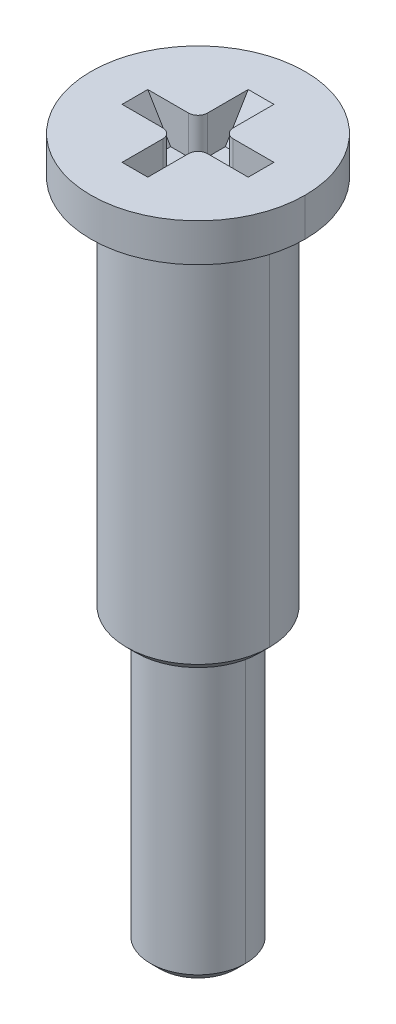
ISO-10303-21;
HEADER;
FILE_DESCRIPTION(('STEP AP214'),'2;1');
FILE_NAME('part.step','',(''),(''),'','','');
FILE_SCHEMA(('AUTOMOTIVE_DESIGN { 1 0 10303 214 1 1 1 1 }'));
ENDSEC;
DATA;
#1=APPLICATION_CONTEXT('core data for automotive mechanical design processes');
#2=APPLICATION_PROTOCOL_DEFINITION('international standard','automotive_design',2000,#1);
#3=PRODUCT_CONTEXT('',#1,'mechanical');
#4=PRODUCT('Part','Part','',(#3));
#5=PRODUCT_RELATED_PRODUCT_CATEGORY('part','',(#4));
#6=PRODUCT_DEFINITION_FORMATION('','',#4);
#7=PRODUCT_DEFINITION_CONTEXT('part definition',#1,'design');
#8=PRODUCT_DEFINITION('design','',#6,#7);
#9=PRODUCT_DEFINITION_SHAPE('','',#8);
#10=(LENGTH_UNIT() NAMED_UNIT(*) SI_UNIT(.MILLI.,.METRE.));
#11=(NAMED_UNIT(*) PLANE_ANGLE_UNIT() SI_UNIT($,.RADIAN.));
#12=(NAMED_UNIT(*) SI_UNIT($,.STERADIAN.) SOLID_ANGLE_UNIT());
#13=UNCERTAINTY_MEASURE_WITH_UNIT(LENGTH_MEASURE(1.E-05),#10,'distance_accuracy_value','');
#14=(GEOMETRIC_REPRESENTATION_CONTEXT(3) GLOBAL_UNCERTAINTY_ASSIGNED_CONTEXT((#13)) GLOBAL_UNIT_ASSIGNED_CONTEXT((#10,
#11,#12)) REPRESENTATION_CONTEXT('',''));
#15=CARTESIAN_POINT('',(0.,0.,0.));
#16=DIRECTION('',(0.,0.,1.));
#17=DIRECTION('',(1.,0.,0.));
#18=AXIS2_PLACEMENT_3D('',#15,#16,#17);
#19=CARTESIAN_POINT('',(0.,0.0999999999933,0.));
#20=DIRECTION('',(0.,1.,0.));
#21=DIRECTION('',(-1.,0.,0.));
#22=AXIS2_PLACEMENT_3D('',#19,#20,#21);
#23=CONICAL_SURFACE('',#22,0.9000000000198,0.7853981633973);
#24=CARTESIAN_POINT('',(0.,0.,0.));
#25=DIRECTION('',(0.,1.,0.));
#26=DIRECTION('',(1.,0.,0.));
#27=AXIS2_PLACEMENT_3D('',#24,#25,#26);
#28=CIRCLE('',#27,0.8000000000266);
#29=CARTESIAN_POINT('',(0.8000000000266,0.,0.));
#30=VERTEX_POINT('',#29);
#31=CARTESIAN_POINT('',(-0.8000000000266,0.,0.));
#32=VERTEX_POINT('',#31);
#33=EDGE_CURVE('E11',#30,#32,#28,.T.);
#34=ORIENTED_EDGE('',*,*,#33,.T.);
#35=DIRECTION('',(-0.707106781174798,0.707106781198297,0.));
#36=VECTOR('',#35,1.);
#37=CARTESIAN_POINT('',(-0.8000000000266,0.,0.));
#38=LINE('',#37,#36);
#39=CARTESIAN_POINT('',(-1.000000000007,0.1999999999866,0.));
#40=VERTEX_POINT('',#39);
#41=EDGE_CURVE('E345',#32,#40,#38,.T.);
#42=ORIENTED_EDGE('',*,*,#41,.T.);
#43=CARTESIAN_POINT('',(0.,0.1999999999866,0.));
#44=DIRECTION('',(0.,1.,0.));
#45=DIRECTION('',(1.,0.,0.));
#46=AXIS2_PLACEMENT_3D('',#43,#44,#45);
#47=CIRCLE('',#46,1.000000000013);
#48=CARTESIAN_POINT('',(1.000000000013,0.1999999999866,0.));
#49=VERTEX_POINT('',#48);
#50=EDGE_CURVE('E451',#49,#40,#47,.T.);
#51=ORIENTED_EDGE('',*,*,#50,.F.);
#52=DIRECTION('',(0.707106781174798,0.707106781198297,0.));
#53=VECTOR('',#52,1.);
#54=CARTESIAN_POINT('',(0.8000000000266,0.,0.));
#55=LINE('',#54,#53);
#56=EDGE_CURVE('E348',#30,#49,#55,.T.);
#57=ORIENTED_EDGE('',*,*,#56,.F.);
#58=EDGE_LOOP('',(#34,#42,#51,#57));
#59=FACE_BOUND('',#58,.T.);
#60=ADVANCED_FACE('F16',(#59),#23,.T.);
#61=CARTESIAN_POINT('',(1.,0.,0.));
#62=DIRECTION('',(0.,-1.,0.));
#63=DIRECTION('',(0.,0.,-1.));
#64=AXIS2_PLACEMENT_3D('',#61,#62,#63);
#65=PLANE('',#64);
#66=ORIENTED_EDGE('',*,*,#33,.F.);
#67=CARTESIAN_POINT('',(0.,0.,0.));
#68=DIRECTION('',(0.,1.,0.));
#69=DIRECTION('',(-1.,0.,0.));
#70=AXIS2_PLACEMENT_3D('',#67,#68,#69);
#71=CIRCLE('',#70,0.8000000000266);
#72=EDGE_CURVE('E27',#32,#30,#71,.T.);
#73=ORIENTED_EDGE('',*,*,#72,.F.);
#74=EDGE_LOOP('',(#66,#73));
#75=FACE_BOUND('',#74,.T.);
#76=ADVANCED_FACE('F629',(#75),#65,.T.);
#77=CARTESIAN_POINT('',(0.,0.0999999999933,0.));
#78=DIRECTION('',(0.,1.,0.));
#79=DIRECTION('',(-1.,0.,0.));
#80=AXIS2_PLACEMENT_3D('',#77,#78,#79);
#81=CONICAL_SURFACE('',#80,0.9000000000198,0.7853981633973);
#82=ORIENTED_EDGE('',*,*,#56,.T.);
#83=CARTESIAN_POINT('',(0.,0.1999999999866,0.));
#84=DIRECTION('',(0.,1.,0.));
#85=DIRECTION('',(-1.,0.,0.));
#86=AXIS2_PLACEMENT_3D('',#83,#84,#85);
#87=CIRCLE('',#86,1.000000000013);
#88=EDGE_CURVE('E408',#40,#49,#87,.T.);
#89=ORIENTED_EDGE('',*,*,#88,.F.);
#90=ORIENTED_EDGE('',*,*,#41,.F.);
#91=ORIENTED_EDGE('',*,*,#72,.T.);
#92=EDGE_LOOP('',(#82,#89,#90,#91));
#93=FACE_BOUND('',#92,.T.);
#94=ADVANCED_FACE('F666',(#93),#81,.T.);
#95=CARTESIAN_POINT('',(0.,0.,0.));
#96=DIRECTION('',(0.,-1.,0.));
#97=DIRECTION('',(1.,0.,0.));
#98=AXIS2_PLACEMENT_3D('',#95,#96,#97);
#99=CYLINDRICAL_SURFACE('',#98,1.);
#100=DIRECTION('',(-1.131049277222E-12,-1.,0.));
#101=VECTOR('',#100,1.);
#102=CARTESIAN_POINT('',(-1.,6.,0.));
#103=LINE('',#102,#101);
#104=CARTESIAN_POINT('',(-1.,6.,0.));
#105=VERTEX_POINT('',#104);
#106=EDGE_CURVE('E454',#105,#40,#103,.T.);
#107=ORIENTED_EDGE('',*,*,#106,.T.);
#108=ORIENTED_EDGE('',*,*,#88,.T.);
#109=DIRECTION('',(1.131049277222E-12,-1.,0.));
#110=VECTOR('',#109,1.);
#111=CARTESIAN_POINT('',(1.,6.,0.));
#112=LINE('',#111,#110);
#113=CARTESIAN_POINT('',(1.,6.,0.));
#114=VERTEX_POINT('',#113);
#115=EDGE_CURVE('E455',#114,#49,#112,.T.);
#116=ORIENTED_EDGE('',*,*,#115,.F.);
#117=CARTESIAN_POINT('',(0.,6.,0.));
#118=DIRECTION('',(0.,-1.,0.));
#119=DIRECTION('',(1.,0.,0.));
#120=AXIS2_PLACEMENT_3D('',#117,#118,#119);
#121=CIRCLE('',#120,1.);
#122=EDGE_CURVE('E336',#114,#105,#121,.T.);
#123=ORIENTED_EDGE('',*,*,#122,.T.);
#124=EDGE_LOOP('',(#107,#108,#116,#123));
#125=FACE_BOUND('',#124,.T.);
#126=ADVANCED_FACE('F825',(#125),#99,.T.);
#127=CARTESIAN_POINT('',(0.,0.,0.));
#128=DIRECTION('',(0.,-1.,0.));
#129=DIRECTION('',(1.,0.,0.));
#130=AXIS2_PLACEMENT_3D('',#127,#128,#129);
#131=CYLINDRICAL_SURFACE('',#130,1.);
#132=CARTESIAN_POINT('',(0.,6.,0.));
#133=DIRECTION('',(0.,-1.,0.));
#134=DIRECTION('',(-1.,0.,0.));
#135=AXIS2_PLACEMENT_3D('',#132,#133,#134);
#136=CIRCLE('',#135,1.);
#137=EDGE_CURVE('E305',#105,#114,#136,.T.);
#138=ORIENTED_EDGE('',*,*,#137,.T.);
#139=ORIENTED_EDGE('',*,*,#115,.T.);
#140=ORIENTED_EDGE('',*,*,#50,.T.);
#141=ORIENTED_EDGE('',*,*,#106,.F.);
#142=EDGE_LOOP('',(#138,#139,#140,#141));
#143=FACE_BOUND('',#142,.T.);
#144=ADVANCED_FACE('F817',(#143),#131,.T.);
#145=CARTESIAN_POINT('',(0.,13.9,0.));
#146=DIRECTION('',(0.,-1.,0.));
#147=DIRECTION('',(-1.,0.,0.));
#148=AXIS2_PLACEMENT_3D('',#145,#146,#147);
#149=TOROIDAL_SURFACE('',#148,1.6,0.1);
#150=CARTESIAN_POINT('',(0.,13.99999995871,0.));
#151=DIRECTION('',(0.,-1.,0.));
#152=DIRECTION('',(-0.999999999766441,0.,-2.16129292315409E-05));
#153=AXIS2_PLACEMENT_3D('',#150,#151,#152);
#154=CIRCLE('',#153,1.600090868526);
#155=CARTESIAN_POINT('',(-1.600090824759,13.99999995875,-3.458264976691E-05));
#156=VERTEX_POINT('',#155);
#157=CARTESIAN_POINT('',(1.600090824777,13.99999995875,3.375212313847E-05));
#158=VERTEX_POINT('',#157);
#159=EDGE_CURVE('E230',#156,#158,#154,.T.);
#160=ORIENTED_EDGE('',*,*,#159,.T.);
#161=CARTESIAN_POINT('',(1.6,13.9,0.));
#162=DIRECTION('',(0.,0.,1.));
#163=DIRECTION('',(0.000908251330036178,0.999999587539676,0.));
#164=AXIS2_PLACEMENT_3D('',#161,#162,#163);
#165=CIRCLE('',#164,0.1);
#166=CARTESIAN_POINT('',(1.5,13.9,0.));
#167=VERTEX_POINT('',#166);
#168=EDGE_CURVE('E383',#158,#167,#165,.T.);
#169=ORIENTED_EDGE('',*,*,#168,.T.);
#170=CARTESIAN_POINT('',(0.,13.9,0.));
#171=DIRECTION('',(0.,-1.,0.));
#172=DIRECTION('',(-1.,0.,0.));
#173=AXIS2_PLACEMENT_3D('',#170,#171,#172);
#174=CIRCLE('',#173,1.5);
#175=CARTESIAN_POINT('',(-1.5,13.9,0.));
#176=VERTEX_POINT('',#175);
#177=EDGE_CURVE('E312',#176,#167,#174,.T.);
#178=ORIENTED_EDGE('',*,*,#177,.F.);
#179=CARTESIAN_POINT('',(-1.6,13.9,0.));
#180=DIRECTION('',(0.,0.,-1.));
#181=DIRECTION('',(-0.000908685260041467,0.999999587145464,0.));
#182=AXIS2_PLACEMENT_3D('',#179,#180,#181);
#183=CIRCLE('',#182,0.1);
#184=EDGE_CURVE('E388',#156,#176,#183,.T.);
#185=ORIENTED_EDGE('',*,*,#184,.F.);
#186=EDGE_LOOP('',(#160,#169,#178,#185));
#187=FACE_BOUND('',#186,.T.);
#188=ADVANCED_FACE('F724',(#187),#149,.F.);
#189=CARTESIAN_POINT('',(-0.845,14.,0.));
#190=DIRECTION('',(0.857492925712544,0.514495755427527,0.));
#191=DIRECTION('',(0.,0.,-1.));
#192=AXIS2_PLACEMENT_3D('',#189,#190,#191);
#193=PLANE('',#192);
#194=DIRECTION('',(0.,0.,-1.));
#195=VECTOR('',#194,1.);
#196=CARTESIAN_POINT('',(-0.845,14.,0.27));
#197=LINE('',#196,#195);
#198=CARTESIAN_POINT('',(-0.845,14.,0.27));
#199=VERTEX_POINT('',#198);
#200=CARTESIAN_POINT('',(-0.845,14.,-0.27));
#201=VERTEX_POINT('',#200);
#202=EDGE_CURVE('E277',#199,#201,#197,.T.);
#203=ORIENTED_EDGE('',*,*,#202,.T.);
#204=DIRECTION('',(-0.514495755427527,0.857492925712544,0.));
#205=VECTOR('',#204,1.);
#206=CARTESIAN_POINT('',(-0.845,14.,-0.27));
#207=LINE('',#206,#205);
#208=CARTESIAN_POINT('',(-1.325,14.8,-0.27));
#209=VERTEX_POINT('',#208);
#210=EDGE_CURVE('E268',#201,#209,#207,.T.);
#211=ORIENTED_EDGE('',*,*,#210,.T.);
#212=DIRECTION('',(0.,0.,-1.));
#213=VECTOR('',#212,1.);
#214=CARTESIAN_POINT('',(-1.325,14.8,0.27));
#215=LINE('',#214,#213);
#216=CARTESIAN_POINT('',(-1.325,14.8,0.27));
#217=VERTEX_POINT('',#216);
#218=EDGE_CURVE('E313',#217,#209,#215,.T.);
#219=ORIENTED_EDGE('',*,*,#218,.F.);
#220=DIRECTION('',(0.514495755427527,-0.857492925712544,0.));
#221=VECTOR('',#220,1.);
#222=CARTESIAN_POINT('',(-1.325,14.8,0.27));
#223=LINE('',#222,#221);
#224=EDGE_CURVE('E1112',#217,#199,#223,.T.);
#225=ORIENTED_EDGE('',*,*,#224,.T.);
#226=EDGE_LOOP('',(#203,#211,#219,#225));
#227=FACE_BOUND('',#226,.T.);
#228=ADVANCED_FACE('F719',(#227),#193,.T.);
#229=CARTESIAN_POINT('',(-1.325,14.,-0.27));
#230=DIRECTION('',(0.,0.,-1.));
#231=DIRECTION('',(0.,-1.,0.));
#232=AXIS2_PLACEMENT_3D('',#229,#230,#231);
#233=PLANE('',#232);
#234=DIRECTION('',(1.,0.,0.));
#235=VECTOR('',#234,1.);
#236=CARTESIAN_POINT('',(-1.325,14.8,-0.27));
#237=LINE('',#236,#235);
#238=CARTESIAN_POINT('',(-0.47,14.8,-0.27));
#239=VERTEX_POINT('',#238);
#240=EDGE_CURVE('E317',#209,#239,#237,.T.);
#241=ORIENTED_EDGE('',*,*,#240,.F.);
#242=ORIENTED_EDGE('',*,*,#210,.F.);
#243=DIRECTION('',(-1.,0.,0.));
#244=VECTOR('',#243,1.);
#245=CARTESIAN_POINT('',(-0.47,14.,-0.27));
#246=LINE('',#245,#244);
#247=CARTESIAN_POINT('',(-0.47,14.,-0.27));
#248=VERTEX_POINT('',#247);
#249=EDGE_CURVE('E272',#248,#201,#246,.T.);
#250=ORIENTED_EDGE('',*,*,#249,.F.);
#251=DIRECTION('',(0.,1.,0.));
#252=VECTOR('',#251,1.);
#253=CARTESIAN_POINT('',(-0.47,14.,-0.27));
#254=LINE('',#253,#252);
#255=EDGE_CURVE('E256',#248,#239,#254,.T.);
#256=ORIENTED_EDGE('',*,*,#255,.T.);
#257=EDGE_LOOP('',(#241,#242,#250,#256));
#258=FACE_BOUND('',#257,.T.);
#259=ADVANCED_FACE('F273',(#258),#233,.F.);
#260=CARTESIAN_POINT('',(-0.47,14.,-0.47));
#261=DIRECTION('',(0.,1.,0.));
#262=DIRECTION('',(-1.,0.,0.));
#263=AXIS2_PLACEMENT_3D('',#260,#261,#262);
#264=CYLINDRICAL_SURFACE('',#263,0.2);
#265=ORIENTED_EDGE('',*,*,#255,.F.);
#266=CARTESIAN_POINT('',(-0.47,14.,-0.47));
#267=DIRECTION('',(0.,1.,0.));
#268=DIRECTION('',(0.,0.,1.));
#269=AXIS2_PLACEMENT_3D('',#266,#267,#268);
#270=CIRCLE('',#269,0.2);
#271=CARTESIAN_POINT('',(-0.27,14.,-0.47));
#272=VERTEX_POINT('',#271);
#273=EDGE_CURVE('E260',#248,#272,#270,.T.);
#274=ORIENTED_EDGE('',*,*,#273,.T.);
#275=DIRECTION('',(0.,-1.,0.));
#276=VECTOR('',#275,1.);
#277=CARTESIAN_POINT('',(-0.27,14.8,-0.47));
#278=LINE('',#277,#276);
#279=CARTESIAN_POINT('',(-0.27,14.8,-0.47));
#280=VERTEX_POINT('',#279);
#281=EDGE_CURVE('E269',#280,#272,#278,.T.);
#282=ORIENTED_EDGE('',*,*,#281,.F.);
#283=CARTESIAN_POINT('',(-0.47,14.8,-0.47));
#284=DIRECTION('',(0.,-1.,0.));
#285=DIRECTION('',(1.,0.,0.));
#286=AXIS2_PLACEMENT_3D('',#283,#284,#285);
#287=CIRCLE('',#286,0.2);
#288=EDGE_CURVE('E263',#280,#239,#287,.T.);
#289=ORIENTED_EDGE('',*,*,#288,.T.);
#290=EDGE_LOOP('',(#265,#274,#282,#289));
#291=FACE_BOUND('',#290,.T.);
#292=ADVANCED_FACE('F258',(#291),#264,.T.);
#293=CARTESIAN_POINT('',(-0.27,14.,-1.325));
#294=DIRECTION('',(-1.,0.,0.));
#295=DIRECTION('',(0.,0.,1.));
#296=AXIS2_PLACEMENT_3D('',#293,#294,#295);
#297=PLANE('',#296);
#298=DIRECTION('',(0.,0.,1.));
#299=VECTOR('',#298,1.);
#300=CARTESIAN_POINT('',(-0.27,14.,-0.845));
#301=LINE('',#300,#299);
#302=CARTESIAN_POINT('',(-0.27,14.,-0.845));
#303=VERTEX_POINT('',#302);
#304=EDGE_CURVE('E283',#303,#272,#301,.T.);
#305=ORIENTED_EDGE('',*,*,#304,.F.);
#306=DIRECTION('',(0.,-0.857492925712544,0.514495755427527));
#307=VECTOR('',#306,1.);
#308=CARTESIAN_POINT('',(-0.27,14.8,-1.325));
#309=LINE('',#308,#307);
#310=CARTESIAN_POINT('',(-0.27,14.8,-1.325));
#311=VERTEX_POINT('',#310);
#312=EDGE_CURVE('E359',#311,#303,#309,.T.);
#313=ORIENTED_EDGE('',*,*,#312,.F.);
#314=DIRECTION('',(0.,0.,-1.));
#315=VECTOR('',#314,1.);
#316=CARTESIAN_POINT('',(-0.27,14.8,-0.47));
#317=LINE('',#316,#315);
#318=EDGE_CURVE('E433',#280,#311,#317,.T.);
#319=ORIENTED_EDGE('',*,*,#318,.F.);
#320=ORIENTED_EDGE('',*,*,#281,.T.);
#321=EDGE_LOOP('',(#305,#313,#319,#320));
#322=FACE_BOUND('',#321,.T.);
#323=ADVANCED_FACE('F538',(#322),#297,.F.);
#324=CARTESIAN_POINT('',(0.,14.,-0.845));
#325=DIRECTION('',(0.,0.514495755427527,0.857492925712544));
#326=DIRECTION('',(1.,0.,0.));
#327=AXIS2_PLACEMENT_3D('',#324,#325,#326);
#328=PLANE('',#327);
#329=DIRECTION('',(1.,0.,0.));
#330=VECTOR('',#329,1.);
#331=CARTESIAN_POINT('',(-0.27,14.,-0.845));
#332=LINE('',#331,#330);
#333=CARTESIAN_POINT('',(0.27,14.,-0.845));
#334=VERTEX_POINT('',#333);
#335=EDGE_CURVE('E290',#303,#334,#332,.T.);
#336=ORIENTED_EDGE('',*,*,#335,.T.);
#337=DIRECTION('',(0.,0.857492925712544,-0.514495755427527));
#338=VECTOR('',#337,1.);
#339=CARTESIAN_POINT('',(0.27,14.,-0.845));
#340=LINE('',#339,#338);
#341=CARTESIAN_POINT('',(0.27,14.8,-1.325));
#342=VERTEX_POINT('',#341);
#343=EDGE_CURVE('E362',#334,#342,#340,.T.);
#344=ORIENTED_EDGE('',*,*,#343,.T.);
#345=DIRECTION('',(1.,0.,0.));
#346=VECTOR('',#345,1.);
#347=CARTESIAN_POINT('',(-0.27,14.8,-1.325));
#348=LINE('',#347,#346);
#349=EDGE_CURVE('E415',#311,#342,#348,.T.);
#350=ORIENTED_EDGE('',*,*,#349,.F.);
#351=ORIENTED_EDGE('',*,*,#312,.T.);
#352=EDGE_LOOP('',(#336,#344,#350,#351));
#353=FACE_BOUND('',#352,.T.);
#354=ADVANCED_FACE('F533',(#353),#328,.T.);
#355=CARTESIAN_POINT('',(0.27,14.,-1.325));
#356=DIRECTION('',(1.,0.,0.));
#357=DIRECTION('',(0.,1.,0.));
#358=AXIS2_PLACEMENT_3D('',#355,#356,#357);
#359=PLANE('',#358);
#360=DIRECTION('',(0.,0.,1.));
#361=VECTOR('',#360,1.);
#362=CARTESIAN_POINT('',(0.27,14.8,-1.325));
#363=LINE('',#362,#361);
#364=CARTESIAN_POINT('',(0.27,14.8,-0.47));
#365=VERTEX_POINT('',#364);
#366=EDGE_CURVE('E353',#342,#365,#363,.T.);
#367=ORIENTED_EDGE('',*,*,#366,.F.);
#368=ORIENTED_EDGE('',*,*,#343,.F.);
#369=DIRECTION('',(0.,0.,-1.));
#370=VECTOR('',#369,1.);
#371=CARTESIAN_POINT('',(0.27,14.,-0.47));
#372=LINE('',#371,#370);
#373=CARTESIAN_POINT('',(0.27,14.,-0.47));
#374=VERTEX_POINT('',#373);
#375=EDGE_CURVE('E478',#374,#334,#372,.T.);
#376=ORIENTED_EDGE('',*,*,#375,.F.);
#377=DIRECTION('',(0.,1.,0.));
#378=VECTOR('',#377,1.);
#379=CARTESIAN_POINT('',(0.27,14.,-0.47));
#380=LINE('',#379,#378);
#381=EDGE_CURVE('E482',#374,#365,#380,.T.);
#382=ORIENTED_EDGE('',*,*,#381,.T.);
#383=EDGE_LOOP('',(#367,#368,#376,#382));
#384=FACE_BOUND('',#383,.T.);
#385=ADVANCED_FACE('F506',(#384),#359,.F.);
#386=CARTESIAN_POINT('',(-0.27,14.,0.27));
#387=DIRECTION('',(-1.,0.,0.));
#388=DIRECTION('',(0.,0.,1.));
#389=AXIS2_PLACEMENT_3D('',#386,#387,#388);
#390=PLANE('',#389);
#391=DIRECTION('',(0.,0.,-1.));
#392=VECTOR('',#391,1.);
#393=CARTESIAN_POINT('',(-0.27,14.8,1.325));
#394=LINE('',#393,#392);
#395=CARTESIAN_POINT('',(-0.27,14.8,1.325));
#396=VERTEX_POINT('',#395);
#397=CARTESIAN_POINT('',(-0.27,14.8,0.47));
#398=VERTEX_POINT('',#397);
#399=EDGE_CURVE('E462',#396,#398,#394,.T.);
#400=ORIENTED_EDGE('',*,*,#399,.F.);
#401=DIRECTION('',(0.,0.857492925712544,0.514495755427527));
#402=VECTOR('',#401,1.);
#403=CARTESIAN_POINT('',(-0.27,14.,0.845));
#404=LINE('',#403,#402);
#405=CARTESIAN_POINT('',(-0.27,14.,0.845));
#406=VERTEX_POINT('',#405);
#407=EDGE_CURVE('E495',#406,#396,#404,.T.);
#408=ORIENTED_EDGE('',*,*,#407,.F.);
#409=DIRECTION('',(0.,0.,1.));
#410=VECTOR('',#409,1.);
#411=CARTESIAN_POINT('',(-0.27,14.,0.47));
#412=LINE('',#411,#410);
#413=CARTESIAN_POINT('',(-0.27,14.,0.47));
#414=VERTEX_POINT('',#413);
#415=EDGE_CURVE('E430',#414,#406,#412,.T.);
#416=ORIENTED_EDGE('',*,*,#415,.F.);
#417=DIRECTION('',(0.,1.,0.));
#418=VECTOR('',#417,1.);
#419=CARTESIAN_POINT('',(-0.27,14.,0.47));
#420=LINE('',#419,#418);
#421=EDGE_CURVE('E493',#414,#398,#420,.T.);
#422=ORIENTED_EDGE('',*,*,#421,.T.);
#423=EDGE_LOOP('',(#400,#408,#416,#422));
#424=FACE_BOUND('',#423,.T.);
#425=ADVANCED_FACE('F640',(#424),#390,.F.);
#426=CARTESIAN_POINT('',(0.,14.,0.845));
#427=DIRECTION('',(0.,0.514495755427527,-0.857492925712544));
#428=DIRECTION('',(-1.,0.,0.));
#429=AXIS2_PLACEMENT_3D('',#426,#427,#428);
#430=PLANE('',#429);
#431=DIRECTION('',(-1.,0.,0.));
#432=VECTOR('',#431,1.);
#433=CARTESIAN_POINT('',(0.27,14.,0.845));
#434=LINE('',#433,#432);
#435=CARTESIAN_POINT('',(0.27,14.,0.845));
#436=VERTEX_POINT('',#435);
#437=EDGE_CURVE('E371',#436,#406,#434,.T.);
#438=ORIENTED_EDGE('',*,*,#437,.T.);
#439=ORIENTED_EDGE('',*,*,#407,.T.);
#440=DIRECTION('',(-1.,0.,0.));
#441=VECTOR('',#440,1.);
#442=CARTESIAN_POINT('',(0.27,14.8,1.325));
#443=LINE('',#442,#441);
#444=CARTESIAN_POINT('',(0.27,14.8,1.325));
#445=VERTEX_POINT('',#444);
#446=EDGE_CURVE('E467',#445,#396,#443,.T.);
#447=ORIENTED_EDGE('',*,*,#446,.F.);
#448=DIRECTION('',(0.,-0.857492925712544,-0.514495755427527));
#449=VECTOR('',#448,1.);
#450=CARTESIAN_POINT('',(0.27,14.8,1.325));
#451=LINE('',#450,#449);
#452=EDGE_CURVE('E328',#445,#436,#451,.T.);
#453=ORIENTED_EDGE('',*,*,#452,.T.);
#454=EDGE_LOOP('',(#438,#439,#447,#453));
#455=FACE_BOUND('',#454,.T.);
#456=ADVANCED_FACE('F687',(#455),#430,.T.);
#457=CARTESIAN_POINT('',(0.27,14.,0.27));
#458=DIRECTION('',(1.,0.,0.));
#459=DIRECTION('',(0.,1.,0.));
#460=AXIS2_PLACEMENT_3D('',#457,#458,#459);
#461=PLANE('',#460);
#462=DIRECTION('',(0.,0.,-1.));
#463=VECTOR('',#462,1.);
#464=CARTESIAN_POINT('',(0.27,14.,0.845));
#465=LINE('',#464,#463);
#466=CARTESIAN_POINT('',(0.27,14.,0.47));
#467=VERTEX_POINT('',#466);
#468=EDGE_CURVE('E366',#436,#467,#465,.T.);
#469=ORIENTED_EDGE('',*,*,#468,.F.);
#470=ORIENTED_EDGE('',*,*,#452,.F.);
#471=DIRECTION('',(0.,0.,1.));
#472=VECTOR('',#471,1.);
#473=CARTESIAN_POINT('',(0.27,14.8,0.47));
#474=LINE('',#473,#472);
#475=CARTESIAN_POINT('',(0.27,14.8,0.47));
#476=VERTEX_POINT('',#475);
#477=EDGE_CURVE('E450',#476,#445,#474,.T.);
#478=ORIENTED_EDGE('',*,*,#477,.F.);
#479=DIRECTION('',(0.,-1.,0.));
#480=VECTOR('',#479,1.);
#481=CARTESIAN_POINT('',(0.27,14.8,0.47));
#482=LINE('',#481,#480);
#483=EDGE_CURVE('E325',#476,#467,#482,.T.);
#484=ORIENTED_EDGE('',*,*,#483,.T.);
#485=EDGE_LOOP('',(#469,#470,#478,#484));
#486=FACE_BOUND('',#485,.T.);
#487=ADVANCED_FACE('F746',(#486),#461,.F.);
#488=CARTESIAN_POINT('',(0.47,14.,0.47));
#489=DIRECTION('',(0.,1.,0.));
#490=DIRECTION('',(-1.,0.,0.));
#491=AXIS2_PLACEMENT_3D('',#488,#489,#490);
#492=CYLINDRICAL_SURFACE('',#491,0.2);
#493=DIRECTION('',(0.,1.,0.));
#494=VECTOR('',#493,1.);
#495=CARTESIAN_POINT('',(0.47,14.,0.27));
#496=LINE('',#495,#494);
#497=CARTESIAN_POINT('',(0.47,14.,0.27));
#498=VERTEX_POINT('',#497);
#499=CARTESIAN_POINT('',(0.47,14.8,0.27));
#500=VERTEX_POINT('',#499);
#501=EDGE_CURVE('E185',#498,#500,#496,.T.);
#502=ORIENTED_EDGE('',*,*,#501,.F.);
#503=CARTESIAN_POINT('',(0.47,14.,0.47));
#504=DIRECTION('',(0.,1.,0.));
#505=DIRECTION('',(0.,0.,-1.));
#506=AXIS2_PLACEMENT_3D('',#503,#504,#505);
#507=CIRCLE('',#506,0.2);
#508=EDGE_CURVE('E370',#498,#467,#507,.T.);
#509=ORIENTED_EDGE('',*,*,#508,.T.);
#510=ORIENTED_EDGE('',*,*,#483,.F.);
#511=CARTESIAN_POINT('',(0.47,14.8,0.47));
#512=DIRECTION('',(0.,-1.,0.));
#513=DIRECTION('',(-1.,0.,0.));
#514=AXIS2_PLACEMENT_3D('',#511,#512,#513);
#515=CIRCLE('',#514,0.2);
#516=EDGE_CURVE('E323',#476,#500,#515,.T.);
#517=ORIENTED_EDGE('',*,*,#516,.T.);
#518=EDGE_LOOP('',(#502,#509,#510,#517));
#519=FACE_BOUND('',#518,.T.);
#520=ADVANCED_FACE('F784',(#519),#492,.T.);
#521=CARTESIAN_POINT('',(0.27,14.,0.27));
#522=DIRECTION('',(0.,0.,1.));
#523=DIRECTION('',(1.,0.,0.));
#524=AXIS2_PLACEMENT_3D('',#521,#522,#523);
#525=PLANE('',#524);
#526=DIRECTION('',(-1.,0.,0.));
#527=VECTOR('',#526,1.);
#528=CARTESIAN_POINT('',(1.325,14.8,0.27));
#529=LINE('',#528,#527);
#530=CARTESIAN_POINT('',(1.325,14.8,0.27));
#531=VERTEX_POINT('',#530);
#532=EDGE_CURVE('E319',#531,#500,#529,.T.);
#533=ORIENTED_EDGE('',*,*,#532,.F.);
#534=DIRECTION('',(0.514495755427527,0.857492925712544,0.));
#535=VECTOR('',#534,1.);
#536=CARTESIAN_POINT('',(0.845,14.,0.27));
#537=LINE('',#536,#535);
#538=CARTESIAN_POINT('',(0.845,14.,0.27));
#539=VERTEX_POINT('',#538);
#540=EDGE_CURVE('E170',#539,#531,#537,.T.);
#541=ORIENTED_EDGE('',*,*,#540,.F.);
#542=DIRECTION('',(1.,0.,0.));
#543=VECTOR('',#542,1.);
#544=CARTESIAN_POINT('',(0.47,14.,0.27));
#545=LINE('',#544,#543);
#546=EDGE_CURVE('E340',#498,#539,#545,.T.);
#547=ORIENTED_EDGE('',*,*,#546,.F.);
#548=ORIENTED_EDGE('',*,*,#501,.T.);
#549=EDGE_LOOP('',(#533,#541,#547,#548));
#550=FACE_BOUND('',#549,.T.);
#551=ADVANCED_FACE('F567',(#550),#525,.F.);
#552=CARTESIAN_POINT('',(0.845,14.,0.));
#553=DIRECTION('',(-0.857492925712544,0.514495755427527,0.));
#554=DIRECTION('',(0.,0.,1.));
#555=AXIS2_PLACEMENT_3D('',#552,#553,#554);
#556=PLANE('',#555);
#557=DIRECTION('',(0.,0.,1.));
#558=VECTOR('',#557,1.);
#559=CARTESIAN_POINT('',(0.845,14.,-0.27));
#560=LINE('',#559,#558);
#561=CARTESIAN_POINT('',(0.845,14.,-0.27));
#562=VERTEX_POINT('',#561);
#563=EDGE_CURVE('E299',#562,#539,#560,.T.);
#564=ORIENTED_EDGE('',*,*,#563,.T.);
#565=ORIENTED_EDGE('',*,*,#540,.T.);
#566=DIRECTION('',(0.,0.,1.));
#567=VECTOR('',#566,1.);
#568=CARTESIAN_POINT('',(1.325,14.8,-0.27));
#569=LINE('',#568,#567);
#570=CARTESIAN_POINT('',(1.325,14.8,-0.27));
#571=VERTEX_POINT('',#570);
#572=EDGE_CURVE('E324',#571,#531,#569,.T.);
#573=ORIENTED_EDGE('',*,*,#572,.F.);
#574=DIRECTION('',(-0.514495755427527,-0.857492925712544,0.));
#575=VECTOR('',#574,1.);
#576=CARTESIAN_POINT('',(1.325,14.8,-0.27));
#577=LINE('',#576,#575);
#578=EDGE_CURVE('E308',#571,#562,#577,.T.);
#579=ORIENTED_EDGE('',*,*,#578,.T.);
#580=EDGE_LOOP('',(#564,#565,#573,#579));
#581=FACE_BOUND('',#580,.T.);
#582=ADVANCED_FACE('F562',(#581),#556,.T.);
#583=CARTESIAN_POINT('',(0.27,14.,-0.27));
#584=DIRECTION('',(0.,0.,-1.));
#585=DIRECTION('',(0.,-1.,0.));
#586=AXIS2_PLACEMENT_3D('',#583,#584,#585);
#587=PLANE('',#586);
#588=DIRECTION('',(-1.,0.,0.));
#589=VECTOR('',#588,1.);
#590=CARTESIAN_POINT('',(0.845,14.,-0.27));
#591=LINE('',#590,#589);
#592=CARTESIAN_POINT('',(0.47,14.,-0.27));
#593=VERTEX_POINT('',#592);
#594=EDGE_CURVE('E296',#562,#593,#591,.T.);
#595=ORIENTED_EDGE('',*,*,#594,.F.);
#596=ORIENTED_EDGE('',*,*,#578,.F.);
#597=DIRECTION('',(1.,0.,0.));
#598=VECTOR('',#597,1.);
#599=CARTESIAN_POINT('',(0.47,14.8,-0.27));
#600=LINE('',#599,#598);
#601=CARTESIAN_POINT('',(0.47,14.8,-0.27));
#602=VERTEX_POINT('',#601);
#603=EDGE_CURVE('E344',#602,#571,#600,.T.);
#604=ORIENTED_EDGE('',*,*,#603,.F.);
#605=DIRECTION('',(0.,-1.,0.));
#606=VECTOR('',#605,1.);
#607=CARTESIAN_POINT('',(0.47,14.8,-0.27));
#608=LINE('',#607,#606);
#609=EDGE_CURVE('E484',#602,#593,#608,.T.);
#610=ORIENTED_EDGE('',*,*,#609,.T.);
#611=EDGE_LOOP('',(#595,#596,#604,#610));
#612=FACE_BOUND('',#611,.T.);
#613=ADVANCED_FACE('F522',(#612),#587,.F.);
#614=CARTESIAN_POINT('',(0.47,14.,-0.47));
#615=DIRECTION('',(0.,1.,0.));
#616=DIRECTION('',(-1.,0.,0.));
#617=AXIS2_PLACEMENT_3D('',#614,#615,#616);
#618=CYLINDRICAL_SURFACE('',#617,0.2);
#619=ORIENTED_EDGE('',*,*,#381,.F.);
#620=CARTESIAN_POINT('',(0.47,14.,-0.47));
#621=DIRECTION('',(0.,1.,0.));
#622=DIRECTION('',(-1.,0.,0.));
#623=AXIS2_PLACEMENT_3D('',#620,#621,#622);
#624=CIRCLE('',#623,0.2);
#625=EDGE_CURVE('E298',#374,#593,#624,.T.);
#626=ORIENTED_EDGE('',*,*,#625,.T.);
#627=ORIENTED_EDGE('',*,*,#609,.F.);
#628=CARTESIAN_POINT('',(0.47,14.8,-0.47));
#629=DIRECTION('',(0.,-1.,0.));
#630=DIRECTION('',(0.,0.,1.));
#631=AXIS2_PLACEMENT_3D('',#628,#629,#630);
#632=CIRCLE('',#631,0.2);
#633=EDGE_CURVE('E349',#602,#365,#632,.T.);
#634=ORIENTED_EDGE('',*,*,#633,.T.);
#635=EDGE_LOOP('',(#619,#626,#627,#634));
#636=FACE_BOUND('',#635,.T.);
#637=ADVANCED_FACE('F18',(#636),#618,.T.);
#638=CARTESIAN_POINT('',(0.,14.,0.));
#639=DIRECTION('',(0.,-1.,0.));
#640=DIRECTION('',(0.,0.,-1.));
#641=AXIS2_PLACEMENT_3D('',#638,#639,#640);
#642=PLANE('',#641);
#643=ORIENTED_EDGE('',*,*,#375,.T.);
#644=ORIENTED_EDGE('',*,*,#335,.F.);
#645=ORIENTED_EDGE('',*,*,#304,.T.);
#646=ORIENTED_EDGE('',*,*,#273,.F.);
#647=ORIENTED_EDGE('',*,*,#249,.T.);
#648=ORIENTED_EDGE('',*,*,#202,.F.);
#649=DIRECTION('',(1.,0.,0.));
#650=VECTOR('',#649,1.);
#651=CARTESIAN_POINT('',(-0.845,14.,0.27));
#652=LINE('',#651,#650);
#653=CARTESIAN_POINT('',(-0.47,14.,0.27));
#654=VERTEX_POINT('',#653);
#655=EDGE_CURVE('E1107',#199,#654,#652,.T.);
#656=ORIENTED_EDGE('',*,*,#655,.T.);
#657=CARTESIAN_POINT('',(-0.47,14.,0.47));
#658=DIRECTION('',(0.,1.,0.));
#659=DIRECTION('',(1.,0.,0.));
#660=AXIS2_PLACEMENT_3D('',#657,#658,#659);
#661=CIRCLE('',#660,0.2);
#662=EDGE_CURVE('E491',#414,#654,#661,.T.);
#663=ORIENTED_EDGE('',*,*,#662,.F.);
#664=ORIENTED_EDGE('',*,*,#415,.T.);
#665=ORIENTED_EDGE('',*,*,#437,.F.);
#666=ORIENTED_EDGE('',*,*,#468,.T.);
#667=ORIENTED_EDGE('',*,*,#508,.F.);
#668=ORIENTED_EDGE('',*,*,#546,.T.);
#669=ORIENTED_EDGE('',*,*,#563,.F.);
#670=ORIENTED_EDGE('',*,*,#594,.T.);
#671=ORIENTED_EDGE('',*,*,#625,.F.);
#672=EDGE_LOOP('',(#643,#644,#645,#646,#647,#648,#656,#663,#664,#665,#666,#667,#668,#669,#670,#671));
#673=FACE_BOUND('',#672,.T.);
#674=ADVANCED_FACE('F280',(#673),#642,.F.);
#675=CARTESIAN_POINT('',(-0.47,14.,0.47));
#676=DIRECTION('',(0.,1.,0.));
#677=DIRECTION('',(-1.,0.,0.));
#678=AXIS2_PLACEMENT_3D('',#675,#676,#677);
#679=CYLINDRICAL_SURFACE('',#678,0.2);
#680=ORIENTED_EDGE('',*,*,#421,.F.);
#681=ORIENTED_EDGE('',*,*,#662,.T.);
#682=DIRECTION('',(0.,-1.,0.));
#683=VECTOR('',#682,1.);
#684=CARTESIAN_POINT('',(-0.47,14.8,0.27));
#685=LINE('',#684,#683);
#686=CARTESIAN_POINT('',(-0.47,14.8,0.27));
#687=VERTEX_POINT('',#686);
#688=EDGE_CURVE('E1095',#687,#654,#685,.T.);
#689=ORIENTED_EDGE('',*,*,#688,.F.);
#690=CARTESIAN_POINT('',(-0.47,14.8,0.47));
#691=DIRECTION('',(0.,-1.,0.));
#692=DIRECTION('',(0.,0.,-1.));
#693=AXIS2_PLACEMENT_3D('',#690,#691,#692);
#694=CIRCLE('',#693,0.2);
#695=EDGE_CURVE('E466',#687,#398,#694,.T.);
#696=ORIENTED_EDGE('',*,*,#695,.T.);
#697=EDGE_LOOP('',(#680,#681,#689,#696));
#698=FACE_BOUND('',#697,.T.);
#699=ADVANCED_FACE('F616',(#698),#679,.T.);
#700=CARTESIAN_POINT('',(-1.325,14.,0.27));
#701=DIRECTION('',(0.,0.,1.));
#702=DIRECTION('',(1.,0.,0.));
#703=AXIS2_PLACEMENT_3D('',#700,#701,#702);
#704=PLANE('',#703);
#705=ORIENTED_EDGE('',*,*,#655,.F.);
#706=ORIENTED_EDGE('',*,*,#224,.F.);
#707=DIRECTION('',(-1.,0.,0.));
#708=VECTOR('',#707,1.);
#709=CARTESIAN_POINT('',(-0.47,14.8,0.27));
#710=LINE('',#709,#708);
#711=EDGE_CURVE('E1101',#687,#217,#710,.T.);
#712=ORIENTED_EDGE('',*,*,#711,.F.);
#713=ORIENTED_EDGE('',*,*,#688,.T.);
#714=EDGE_LOOP('',(#705,#706,#712,#713));
#715=FACE_BOUND('',#714,.T.);
#716=ADVANCED_FACE('F553',(#715),#704,.F.);
#717=CARTESIAN_POINT('',(0.,0.,0.));
#718=DIRECTION('',(0.,-1.,0.));
#719=DIRECTION('',(1.,0.,0.));
#720=AXIS2_PLACEMENT_3D('',#717,#718,#719);
#721=CYLINDRICAL_SURFACE('',#720,2.25);
#722=CARTESIAN_POINT('',(0.,14.8,0.));
#723=DIRECTION('',(0.,-1.,0.));
#724=DIRECTION('',(-1.,0.,0.));
#725=AXIS2_PLACEMENT_3D('',#722,#723,#724);
#726=CIRCLE('',#725,2.25);
#727=CARTESIAN_POINT('',(-2.25,14.8,0.));
#728=VERTEX_POINT('',#727);
#729=CARTESIAN_POINT('',(2.25,14.8,0.));
#730=VERTEX_POINT('',#729);
#731=EDGE_CURVE('E318',#728,#730,#726,.T.);
#732=ORIENTED_EDGE('',*,*,#731,.T.);
#733=DIRECTION('',(0.,-1.,0.));
#734=VECTOR('',#733,1.);
#735=CARTESIAN_POINT('',(2.25,14.8,0.));
#736=LINE('',#735,#734);
#737=CARTESIAN_POINT('',(2.25,14.,0.));
#738=VERTEX_POINT('',#737);
#739=EDGE_CURVE('E241',#730,#738,#736,.T.);
#740=ORIENTED_EDGE('',*,*,#739,.T.);
#741=CARTESIAN_POINT('',(0.,14.,0.));
#742=DIRECTION('',(0.,1.,0.));
#743=DIRECTION('',(1.,0.,0.));
#744=AXIS2_PLACEMENT_3D('',#741,#742,#743);
#745=CIRCLE('',#744,2.25);
#746=CARTESIAN_POINT('',(-2.25,14.,0.));
#747=VERTEX_POINT('',#746);
#748=EDGE_CURVE('E382',#738,#747,#745,.T.);
#749=ORIENTED_EDGE('',*,*,#748,.T.);
#750=DIRECTION('',(0.,-1.,0.));
#751=VECTOR('',#750,1.);
#752=CARTESIAN_POINT('',(-2.25,14.8,0.));
#753=LINE('',#752,#751);
#754=EDGE_CURVE('E374',#728,#747,#753,.T.);
#755=ORIENTED_EDGE('',*,*,#754,.F.);
#756=EDGE_LOOP('',(#732,#740,#749,#755));
#757=FACE_BOUND('',#756,.T.);
#758=ADVANCED_FACE('F547',(#757),#721,.T.);
#759=CARTESIAN_POINT('',(0.,14.8,0.));
#760=DIRECTION('',(0.,1.,0.));
#761=DIRECTION('',(1.,0.,0.));
#762=AXIS2_PLACEMENT_3D('',#759,#760,#761);
#763=PLANE('',#762);
#764=ORIENTED_EDGE('',*,*,#218,.T.);
#765=ORIENTED_EDGE('',*,*,#240,.T.);
#766=ORIENTED_EDGE('',*,*,#288,.F.);
#767=ORIENTED_EDGE('',*,*,#318,.T.);
#768=ORIENTED_EDGE('',*,*,#349,.T.);
#769=ORIENTED_EDGE('',*,*,#366,.T.);
#770=ORIENTED_EDGE('',*,*,#633,.F.);
#771=ORIENTED_EDGE('',*,*,#603,.T.);
#772=ORIENTED_EDGE('',*,*,#572,.T.);
#773=ORIENTED_EDGE('',*,*,#532,.T.);
#774=ORIENTED_EDGE('',*,*,#516,.F.);
#775=ORIENTED_EDGE('',*,*,#477,.T.);
#776=ORIENTED_EDGE('',*,*,#446,.T.);
#777=ORIENTED_EDGE('',*,*,#399,.T.);
#778=ORIENTED_EDGE('',*,*,#695,.F.);
#779=ORIENTED_EDGE('',*,*,#711,.T.);
#780=EDGE_LOOP('',(#764,#765,#766,#767,#768,#769,#770,#771,#772,#773,#774,#775,#776,#777,#778,#779));
#781=FACE_BOUND('',#780,.T.);
#782=ORIENTED_EDGE('',*,*,#731,.F.);
#783=CARTESIAN_POINT('',(0.,14.8,0.));
#784=DIRECTION('',(0.,-1.,0.));
#785=DIRECTION('',(1.,0.,0.));
#786=AXIS2_PLACEMENT_3D('',#783,#784,#785);
#787=CIRCLE('',#786,2.25);
#788=EDGE_CURVE('E424',#730,#728,#787,.T.);
#789=ORIENTED_EDGE('',*,*,#788,.F.);
#790=EDGE_LOOP('',(#782,#789));
#791=FACE_BOUND('',#790,.T.);
#792=ADVANCED_FACE('F552',(#781,#791),#763,.T.);
#793=CARTESIAN_POINT('',(0.,0.,0.));
#794=DIRECTION('',(0.,-1.,0.));
#795=DIRECTION('',(1.,0.,0.));
#796=AXIS2_PLACEMENT_3D('',#793,#794,#795);
#797=CYLINDRICAL_SURFACE('',#796,2.25);
#798=ORIENTED_EDGE('',*,*,#754,.T.);
#799=CARTESIAN_POINT('',(0.,14.,0.));
#800=DIRECTION('',(0.,1.,0.));
#801=DIRECTION('',(-1.,0.,0.));
#802=AXIS2_PLACEMENT_3D('',#799,#800,#801);
#803=CIRCLE('',#802,2.25);
#804=EDGE_CURVE('E375',#747,#738,#803,.T.);
#805=ORIENTED_EDGE('',*,*,#804,.T.);
#806=ORIENTED_EDGE('',*,*,#739,.F.);
#807=ORIENTED_EDGE('',*,*,#788,.T.);
#808=EDGE_LOOP('',(#798,#805,#806,#807));
#809=FACE_BOUND('',#808,.T.);
#810=ADVANCED_FACE('F605',(#809),#797,.T.);
#811=CARTESIAN_POINT('',(2.25,14.,0.));
#812=DIRECTION('',(0.,-1.,0.));
#813=DIRECTION('',(0.,0.,-1.));
#814=AXIS2_PLACEMENT_3D('',#811,#812,#813);
#815=PLANE('',#814);
#816=CARTESIAN_POINT('',(0.,13.99999995875,0.));
#817=DIRECTION('',(0.,-1.,0.));
#818=DIRECTION('',(0.999999999777524,0.,2.10938795525305E-05));
#819=AXIS2_PLACEMENT_3D('',#816,#817,#818);
#820=CIRCLE('',#819,1.600090825133);
#821=EDGE_CURVE('E378',#158,#156,#820,.T.);
#822=ORIENTED_EDGE('',*,*,#821,.F.);
#823=ORIENTED_EDGE('',*,*,#159,.F.);
#824=EDGE_LOOP('',(#822,#823));
#825=FACE_BOUND('',#824,.T.);
#826=ORIENTED_EDGE('',*,*,#748,.F.);
#827=ORIENTED_EDGE('',*,*,#804,.F.);
#828=EDGE_LOOP('',(#826,#827));
#829=FACE_BOUND('',#828,.T.);
#830=ADVANCED_FACE('F654',(#825,#829),#815,.T.);
#831=CARTESIAN_POINT('',(0.,13.9,0.));
#832=DIRECTION('',(0.,-1.,0.));
#833=DIRECTION('',(1.,0.,0.));
#834=AXIS2_PLACEMENT_3D('',#831,#832,#833);
#835=TOROIDAL_SURFACE('',#834,1.6,0.1);
#836=ORIENTED_EDGE('',*,*,#184,.T.);
#837=CARTESIAN_POINT('',(0.,13.9,0.));
#838=DIRECTION('',(0.,-1.,0.));
#839=DIRECTION('',(1.,0.,0.));
#840=AXIS2_PLACEMENT_3D('',#837,#838,#839);
#841=CIRCLE('',#840,1.5);
#842=EDGE_CURVE('E365',#167,#176,#841,.T.);
#843=ORIENTED_EDGE('',*,*,#842,.F.);
#844=ORIENTED_EDGE('',*,*,#168,.F.);
#845=ORIENTED_EDGE('',*,*,#821,.T.);
#846=EDGE_LOOP('',(#836,#843,#844,#845));
#847=FACE_BOUND('',#846,.T.);
#848=ADVANCED_FACE('F648',(#847),#835,.F.);
#849=CARTESIAN_POINT('',(0.,0.,0.));
#850=DIRECTION('',(0.,-1.,0.));
#851=DIRECTION('',(1.,0.,0.));
#852=AXIS2_PLACEMENT_3D('',#849,#850,#851);
#853=CYLINDRICAL_SURFACE('',#852,1.5);
#854=DIRECTION('',(-9.434300382737E-13,-1.,0.));
#855=VECTOR('',#854,1.);
#856=CARTESIAN_POINT('',(-1.5,13.9,0.));
#857=LINE('',#856,#855);
#858=CARTESIAN_POINT('',(-1.500000000022,6.199999999978,0.));
#859=VERTEX_POINT('',#858);
#860=EDGE_CURVE('E332',#176,#859,#857,.T.);
#861=ORIENTED_EDGE('',*,*,#860,.T.);
#862=CARTESIAN_POINT('',(0.,6.199999999978,0.));
#863=DIRECTION('',(0.,1.,0.));
#864=DIRECTION('',(-1.,0.,0.));
#865=AXIS2_PLACEMENT_3D('',#862,#863,#864);
#866=CIRCLE('',#865,1.500000000022);
#867=CARTESIAN_POINT('',(0.,6.199999999978,1.500000000015));
#868=VERTEX_POINT('',#867);
#869=EDGE_CURVE('E301',#859,#868,#866,.T.);
#870=ORIENTED_EDGE('',*,*,#869,.T.);
#871=CARTESIAN_POINT('',(0.,6.199999999978,0.));
#872=DIRECTION('',(0.,1.,0.));
#873=DIRECTION('',(0.,0.,1.));
#874=AXIS2_PLACEMENT_3D('',#871,#872,#873);
#875=CIRCLE('',#874,1.500000000022);
#876=CARTESIAN_POINT('',(1.500000000022,6.199999999978,0.));
#877=VERTEX_POINT('',#876);
#878=EDGE_CURVE('E354',#868,#877,#875,.T.);
#879=ORIENTED_EDGE('',*,*,#878,.T.);
#880=DIRECTION('',(9.434300382737E-13,-1.,0.));
#881=VECTOR('',#880,1.);
#882=CARTESIAN_POINT('',(1.5,13.9,0.));
#883=LINE('',#882,#881);
#884=EDGE_CURVE('E329',#167,#877,#883,.T.);
#885=ORIENTED_EDGE('',*,*,#884,.F.);
#886=ORIENTED_EDGE('',*,*,#842,.T.);
#887=EDGE_LOOP('',(#861,#870,#879,#885,#886));
#888=FACE_BOUND('',#887,.T.);
#889=ADVANCED_FACE('F653',(#888),#853,.T.);
#890=CARTESIAN_POINT('',(0.,0.,0.));
#891=DIRECTION('',(0.,-1.,0.));
#892=DIRECTION('',(1.,0.,0.));
#893=AXIS2_PLACEMENT_3D('',#890,#891,#892);
#894=CYLINDRICAL_SURFACE('',#893,1.5);
#895=ORIENTED_EDGE('',*,*,#177,.T.);
#896=ORIENTED_EDGE('',*,*,#884,.T.);
#897=CARTESIAN_POINT('',(0.,6.199999999978,0.));
#898=DIRECTION('',(0.,1.,0.));
#899=DIRECTION('',(1.,0.,0.));
#900=AXIS2_PLACEMENT_3D('',#897,#898,#899);
#901=CIRCLE('',#900,1.500000000022);
#902=CARTESIAN_POINT('',(0.,6.199999999978,-1.500000000022));
#903=VERTEX_POINT('',#902);
#904=EDGE_CURVE('E294',#877,#903,#901,.T.);
#905=ORIENTED_EDGE('',*,*,#904,.T.);
#906=CARTESIAN_POINT('',(0.,6.199999999978,0.));
#907=DIRECTION('',(0.,1.,0.));
#908=DIRECTION('',(0.,0.,-1.));
#909=AXIS2_PLACEMENT_3D('',#906,#907,#908);
#910=CIRCLE('',#909,1.500000000022);
#911=EDGE_CURVE('E304',#903,#859,#910,.T.);
#912=ORIENTED_EDGE('',*,*,#911,.T.);
#913=ORIENTED_EDGE('',*,*,#860,.F.);
#914=EDGE_LOOP('',(#895,#896,#905,#912,#913));
#915=FACE_BOUND('',#914,.T.);
#916=ADVANCED_FACE('F582',(#915),#894,.T.);
#917=CARTESIAN_POINT('',(0.,6.099999999975,0.));
#918=DIRECTION('',(0.,1.,0.));
#919=DIRECTION('',(0.,0.,1.));
#920=AXIS2_PLACEMENT_3D('',#917,#918,#919);
#921=CONICAL_SURFACE('',#920,1.400000000047,0.78539816325523);
#922=CARTESIAN_POINT('',(0.,5.999999999972,0.));
#923=DIRECTION('',(0.,1.,0.));
#924=DIRECTION('',(0.,0.,-1.));
#925=AXIS2_PLACEMENT_3D('',#922,#923,#924);
#926=CIRCLE('',#925,1.300000000072);
#927=CARTESIAN_POINT('',(0.,5.999999999972,-1.300000000072));
#928=VERTEX_POINT('',#927);
#929=CARTESIAN_POINT('',(0.,5.999999999972,1.300000000072));
#930=VERTEX_POINT('',#929);
#931=EDGE_CURVE('E333',#928,#930,#926,.T.);
#932=ORIENTED_EDGE('',*,*,#931,.T.);
#933=DIRECTION('',(0.,0.707106781283598,0.707106781089497));
#934=VECTOR('',#933,1.);
#935=CARTESIAN_POINT('',(0.,5.999999999981,1.300000000072));
#936=LINE('',#935,#934);
#937=EDGE_CURVE('E358',#930,#868,#936,.T.);
#938=ORIENTED_EDGE('',*,*,#937,.T.);
#939=ORIENTED_EDGE('',*,*,#869,.F.);
#940=ORIENTED_EDGE('',*,*,#911,.F.);
#941=DIRECTION('',(0.,0.707106781283598,-0.707106781089497));
#942=VECTOR('',#941,1.);
#943=CARTESIAN_POINT('',(0.,5.999999999981,-1.300000000072));
#944=LINE('',#943,#942);
#945=EDGE_CURVE('E1162',#928,#903,#944,.T.);
#946=ORIENTED_EDGE('',*,*,#945,.F.);
#947=EDGE_LOOP('',(#932,#938,#939,#940,#946));
#948=FACE_BOUND('',#947,.T.);
#949=ADVANCED_FACE('F576',(#948),#921,.T.);
#950=CARTESIAN_POINT('',(1.5,6.,0.));
#951=DIRECTION('',(0.,-1.,0.));
#952=DIRECTION('',(0.,0.,-1.));
#953=AXIS2_PLACEMENT_3D('',#950,#951,#952);
#954=PLANE('',#953);
#955=ORIENTED_EDGE('',*,*,#122,.F.);
#956=ORIENTED_EDGE('',*,*,#137,.F.);
#957=EDGE_LOOP('',(#955,#956));
#958=FACE_BOUND('',#957,.T.);
#959=ORIENTED_EDGE('',*,*,#931,.F.);
#960=CARTESIAN_POINT('',(0.,5.999999999972,0.));
#961=DIRECTION('',(0.,1.,0.));
#962=DIRECTION('',(0.,0.,1.));
#963=AXIS2_PLACEMENT_3D('',#960,#961,#962);
#964=CIRCLE('',#963,1.300000000072);
#965=EDGE_CURVE('E337',#930,#928,#964,.T.);
#966=ORIENTED_EDGE('',*,*,#965,.F.);
#967=EDGE_LOOP('',(#959,#966));
#968=FACE_BOUND('',#967,.T.);
#969=ADVANCED_FACE('F581',(#958,#968),#954,.T.);
#970=CARTESIAN_POINT('',(0.,6.099999999975,0.));
#971=DIRECTION('',(0.,1.,0.));
#972=DIRECTION('',(0.,0.,1.));
#973=AXIS2_PLACEMENT_3D('',#970,#971,#972);
#974=CONICAL_SURFACE('',#973,1.400000000047,0.78539816325523);
#975=ORIENTED_EDGE('',*,*,#945,.T.);
#976=ORIENTED_EDGE('',*,*,#904,.F.);
#977=ORIENTED_EDGE('',*,*,#878,.F.);
#978=ORIENTED_EDGE('',*,*,#937,.F.);
#979=ORIENTED_EDGE('',*,*,#965,.T.);
#980=EDGE_LOOP('',(#975,#976,#977,#978,#979));
#981=FACE_BOUND('',#980,.T.);
#982=ADVANCED_FACE('F710',(#981),#974,.T.);
#983=CLOSED_SHELL('',(#60,#76,#94,#126,#144,#188,#228,#259,#292,#323,#354,#385,#425,#456,#487,
#520,#551,#582,#613,#637,#674,#699,#716,#758,#792,#810,#830,#848,#889,#916,#949,#969,#982));
#984=MANIFOLD_SOLID_BREP('B1',#983);
#985=ADVANCED_BREP_SHAPE_REPRESENTATION('',(#18,#984),#14);
#986=SHAPE_DEFINITION_REPRESENTATION(#9,#985);
ENDSEC;
END-ISO-10303-21;
